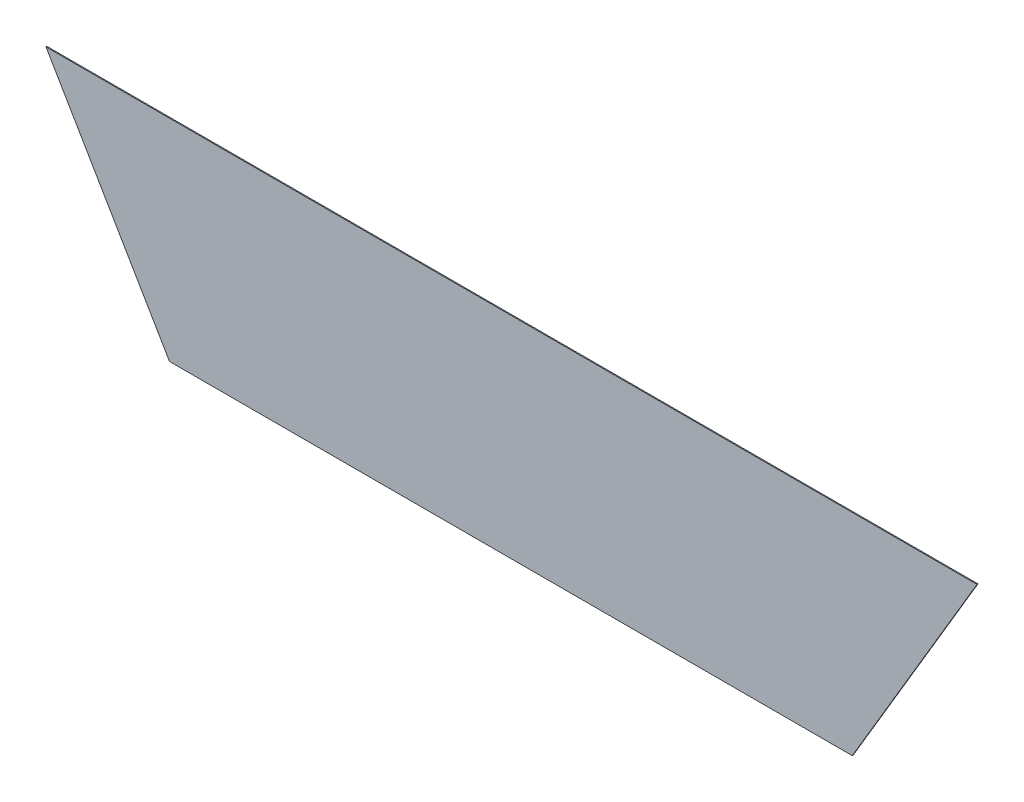
ISO-10303-21;
HEADER;
FILE_DESCRIPTION(('STEP AP214'),'2;1');
FILE_NAME('part.step','',(''),(''),'','','');
FILE_SCHEMA(('AUTOMOTIVE_DESIGN { 1 0 10303 214 1 1 1 1 }'));
ENDSEC;
DATA;
#1=APPLICATION_CONTEXT('core data for automotive mechanical design processes');
#2=APPLICATION_PROTOCOL_DEFINITION('international standard','automotive_design',2000,#1);
#3=PRODUCT_CONTEXT('',#1,'mechanical');
#4=PRODUCT('Part','Part','',(#3));
#5=PRODUCT_RELATED_PRODUCT_CATEGORY('part','',(#4));
#6=PRODUCT_DEFINITION_FORMATION('','',#4);
#7=PRODUCT_DEFINITION_CONTEXT('part definition',#1,'design');
#8=PRODUCT_DEFINITION('design','',#6,#7);
#9=PRODUCT_DEFINITION_SHAPE('','',#8);
#10=(LENGTH_UNIT() NAMED_UNIT(*) SI_UNIT(.MILLI.,.METRE.));
#11=(NAMED_UNIT(*) PLANE_ANGLE_UNIT() SI_UNIT($,.RADIAN.));
#12=(NAMED_UNIT(*) SI_UNIT($,.STERADIAN.) SOLID_ANGLE_UNIT());
#13=UNCERTAINTY_MEASURE_WITH_UNIT(LENGTH_MEASURE(1.E-05),#10,'distance_accuracy_value','');
#14=(GEOMETRIC_REPRESENTATION_CONTEXT(3) GLOBAL_UNCERTAINTY_ASSIGNED_CONTEXT((#13)) GLOBAL_UNIT_ASSIGNED_CONTEXT((#10,
#11,#12)) REPRESENTATION_CONTEXT('',''));
#15=CARTESIAN_POINT('',(0.,0.,0.));
#16=DIRECTION('',(0.,0.,1.));
#17=DIRECTION('',(1.,0.,0.));
#18=AXIS2_PLACEMENT_3D('',#15,#16,#17);
#19=CARTESIAN_POINT('',(-0.108604065324,0.946339992680325,0.00015));
#20=DIRECTION('',(-0.862752742691062,-0.50562605251218,0.));
#21=DIRECTION('',(0.,0.,1.));
#22=AXIS2_PLACEMENT_3D('',#19,#20,#21);
#23=PLANE('',#22);
#24=DIRECTION('',(0.,0.,1.));
#25=VECTOR('',#24,1.);
#26=CARTESIAN_POINT('',(-0.0989000006156502,0.92978188931365,0.));
#27=LINE('',#26,#25);
#28=CARTESIAN_POINT('',(-0.0989000006156502,0.92978188931365,0.));
#29=VERTEX_POINT('',#28);
#30=CARTESIAN_POINT('',(-0.0989000006156502,0.92978188931365,0.00015));
#31=VERTEX_POINT('',#30);
#32=EDGE_CURVE('E11',#29,#31,#27,.T.);
#33=ORIENTED_EDGE('',*,*,#32,.T.);
#34=DIRECTION('',(-0.505626052512179,0.862752742691063,0.));
#35=VECTOR('',#34,1.);
#36=CARTESIAN_POINT('',(-0.0989000006156502,0.92978188931365,0.00015));
#37=LINE('',#36,#35);
#38=CARTESIAN_POINT('',(-0.11830813003235,0.962898096047,0.00015));
#39=VERTEX_POINT('',#38);
#40=EDGE_CURVE('E24',#31,#39,#37,.T.);
#41=ORIENTED_EDGE('',*,*,#40,.T.);
#42=DIRECTION('',(0.,0.,1.));
#43=VECTOR('',#42,1.);
#44=CARTESIAN_POINT('',(-0.11830813003235,0.962898096047,0.));
#45=LINE('',#44,#43);
#46=CARTESIAN_POINT('',(-0.11830813003235,0.962898096047,0.));
#47=VERTEX_POINT('',#46);
#48=EDGE_CURVE('E85',#47,#39,#45,.T.);
#49=ORIENTED_EDGE('',*,*,#48,.F.);
#50=DIRECTION('',(-0.505626052512179,0.862752742691063,0.));
#51=VECTOR('',#50,1.);
#52=CARTESIAN_POINT('',(-0.0989000006156502,0.92978188931365,0.));
#53=LINE('',#52,#51);
#54=EDGE_CURVE('E83',#29,#47,#53,.T.);
#55=ORIENTED_EDGE('',*,*,#54,.F.);
#56=EDGE_LOOP('',(#33,#41,#49,#55));
#57=FACE_BOUND('',#56,.T.);
#58=ADVANCED_FACE('F17',(#57),#23,.T.);
#59=CARTESIAN_POINT('',(-0.0451418287740002,0.962898096047,0.00015));
#60=DIRECTION('',(0.,1.,0.));
#61=DIRECTION('',(0.,0.,1.));
#62=AXIS2_PLACEMENT_3D('',#59,#60,#61);
#63=PLANE('',#62);
#64=ORIENTED_EDGE('',*,*,#48,.T.);
#65=DIRECTION('',(1.,0.,0.));
#66=VECTOR('',#65,1.);
#67=CARTESIAN_POINT('',(-0.11830813003235,0.962898096047,0.00015));
#68=LINE('',#67,#66);
#69=CARTESIAN_POINT('',(0.0280244724843498,0.962898096047,0.00015));
#70=VERTEX_POINT('',#69);
#71=EDGE_CURVE('E81',#39,#70,#68,.T.);
#72=ORIENTED_EDGE('',*,*,#71,.T.);
#73=DIRECTION('',(0.,0.,1.));
#74=VECTOR('',#73,1.);
#75=CARTESIAN_POINT('',(0.0280244724843498,0.962898096047,0.));
#76=LINE('',#75,#74);
#77=CARTESIAN_POINT('',(0.0280244724843498,0.962898096047,0.));
#78=VERTEX_POINT('',#77);
#79=EDGE_CURVE('E79',#78,#70,#76,.T.);
#80=ORIENTED_EDGE('',*,*,#79,.F.);
#81=DIRECTION('',(1.,0.,0.));
#82=VECTOR('',#81,1.);
#83=CARTESIAN_POINT('',(-0.11830813003235,0.962898096047,0.));
#84=LINE('',#83,#82);
#85=EDGE_CURVE('E70',#47,#78,#84,.T.);
#86=ORIENTED_EDGE('',*,*,#85,.F.);
#87=EDGE_LOOP('',(#64,#72,#80,#86));
#88=FACE_BOUND('',#87,.T.);
#89=ADVANCED_FACE('F90',(#88),#63,.T.);
#90=CARTESIAN_POINT('',(0.0182182817843498,0.946339992680325,0.00015));
#91=DIRECTION('',(0.860428671084323,-0.509570899852087,0.));
#92=DIRECTION('',(0.,0.,-1.));
#93=AXIS2_PLACEMENT_3D('',#90,#91,#92);
#94=PLANE('',#93);
#95=ORIENTED_EDGE('',*,*,#79,.T.);
#96=DIRECTION('',(-0.509570899852087,-0.860428671084323,0.));
#97=VECTOR('',#96,1.);
#98=CARTESIAN_POINT('',(0.0280244724843498,0.962898096047,0.00015));
#99=LINE('',#98,#97);
#100=CARTESIAN_POINT('',(0.00841209108434982,0.92978188931365,0.00015));
#101=VERTEX_POINT('',#100);
#102=EDGE_CURVE('E60',#70,#101,#99,.T.);
#103=ORIENTED_EDGE('',*,*,#102,.T.);
#104=DIRECTION('',(0.,0.,1.));
#105=VECTOR('',#104,1.);
#106=CARTESIAN_POINT('',(0.00841209108434982,0.92978188931365,0.));
#107=LINE('',#106,#105);
#108=CARTESIAN_POINT('',(0.00841209108434982,0.92978188931365,0.));
#109=VERTEX_POINT('',#108);
#110=EDGE_CURVE('E54',#109,#101,#107,.T.);
#111=ORIENTED_EDGE('',*,*,#110,.F.);
#112=DIRECTION('',(-0.509570899852087,-0.860428671084323,0.));
#113=VECTOR('',#112,1.);
#114=CARTESIAN_POINT('',(0.0280244724843498,0.962898096047,0.));
#115=LINE('',#114,#113);
#116=EDGE_CURVE('E58',#78,#109,#115,.T.);
#117=ORIENTED_EDGE('',*,*,#116,.F.);
#118=EDGE_LOOP('',(#95,#103,#111,#117));
#119=FACE_BOUND('',#118,.T.);
#120=ADVANCED_FACE('F57',(#119),#94,.T.);
#121=CARTESIAN_POINT('',(-0.0452439547656502,0.92978188931365,0.00015));
#122=DIRECTION('',(0.,-1.,0.));
#123=DIRECTION('',(0.,0.,-1.));
#124=AXIS2_PLACEMENT_3D('',#121,#122,#123);
#125=PLANE('',#124);
#126=ORIENTED_EDGE('',*,*,#110,.T.);
#127=DIRECTION('',(-1.,0.,0.));
#128=VECTOR('',#127,1.);
#129=CARTESIAN_POINT('',(0.00841209108434982,0.92978188931365,0.00015));
#130=LINE('',#129,#128);
#131=EDGE_CURVE('E71',#101,#31,#130,.T.);
#132=ORIENTED_EDGE('',*,*,#131,.T.);
#133=ORIENTED_EDGE('',*,*,#32,.F.);
#134=DIRECTION('',(-1.,0.,0.));
#135=VECTOR('',#134,1.);
#136=CARTESIAN_POINT('',(0.00841209108434982,0.92978188931365,0.));
#137=LINE('',#136,#135);
#138=EDGE_CURVE('E68',#109,#29,#137,.T.);
#139=ORIENTED_EDGE('',*,*,#138,.F.);
#140=EDGE_LOOP('',(#126,#132,#133,#139));
#141=FACE_BOUND('',#140,.T.);
#142=ADVANCED_FACE('F73',(#141),#125,.T.);
#143=CARTESIAN_POINT('',(-0.0451418287740002,0.92978188931365,0.));
#144=DIRECTION('',(0.,0.,1.));
#145=DIRECTION('',(1.,0.,0.));
#146=AXIS2_PLACEMENT_3D('',#143,#144,#145);
#147=PLANE('',#146);
#148=ORIENTED_EDGE('',*,*,#54,.T.);
#149=ORIENTED_EDGE('',*,*,#85,.T.);
#150=ORIENTED_EDGE('',*,*,#116,.T.);
#151=ORIENTED_EDGE('',*,*,#138,.T.);
#152=EDGE_LOOP('',(#148,#149,#150,#151));
#153=FACE_BOUND('',#152,.T.);
#154=ADVANCED_FACE('F67',(#153),#147,.F.);
#155=CARTESIAN_POINT('',(-0.0451418287740002,0.92978188931365,0.00015));
#156=DIRECTION('',(0.,0.,1.));
#157=DIRECTION('',(1.,0.,0.));
#158=AXIS2_PLACEMENT_3D('',#155,#156,#157);
#159=PLANE('',#158);
#160=ORIENTED_EDGE('',*,*,#40,.F.);
#161=ORIENTED_EDGE('',*,*,#131,.F.);
#162=ORIENTED_EDGE('',*,*,#102,.F.);
#163=ORIENTED_EDGE('',*,*,#71,.F.);
#164=EDGE_LOOP('',(#160,#161,#162,#163));
#165=FACE_BOUND('',#164,.T.);
#166=ADVANCED_FACE('F91',(#165),#159,.T.);
#167=CLOSED_SHELL('',(#58,#89,#120,#142,#154,#166));
#168=MANIFOLD_SOLID_BREP('B1',#167);
#169=ADVANCED_BREP_SHAPE_REPRESENTATION('',(#18,#168),#14);
#170=SHAPE_DEFINITION_REPRESENTATION(#9,#169);
ENDSEC;
END-ISO-10303-21;
